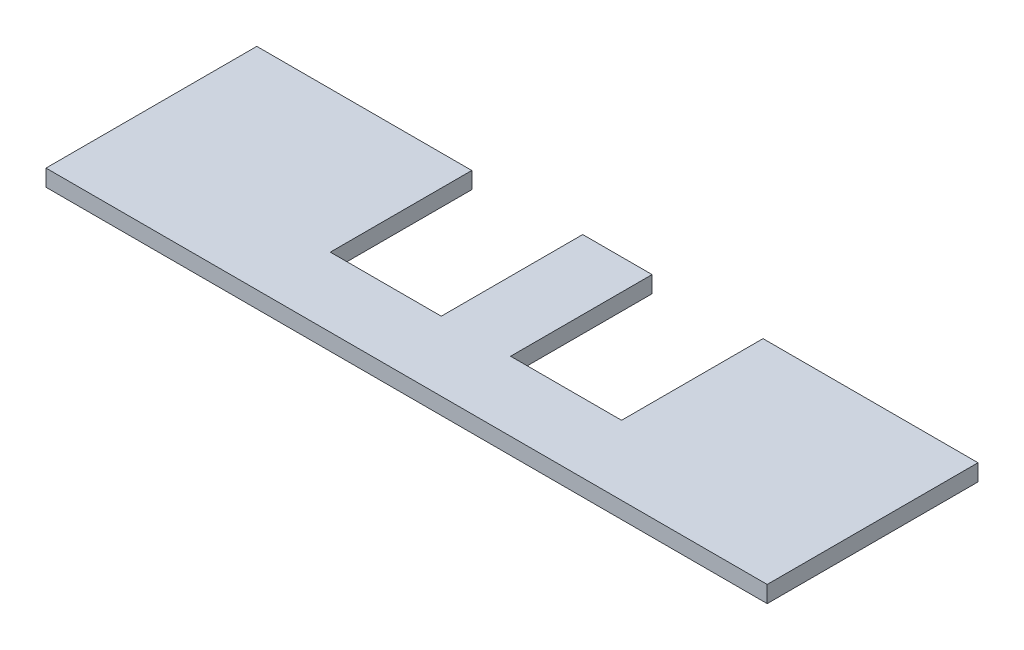
ISO-10303-21;
HEADER;
FILE_DESCRIPTION(('STEP AP214'),'2;1');
FILE_NAME('part.step','',(''),(''),'','','');
FILE_SCHEMA(('AUTOMOTIVE_DESIGN { 1 0 10303 214 1 1 1 1 }'));
ENDSEC;
DATA;
#1=APPLICATION_CONTEXT('core data for automotive mechanical design processes');
#2=APPLICATION_PROTOCOL_DEFINITION('international standard','automotive_design',2000,#1);
#3=PRODUCT_CONTEXT('',#1,'mechanical');
#4=PRODUCT('Part','Part','',(#3));
#5=PRODUCT_RELATED_PRODUCT_CATEGORY('part','',(#4));
#6=PRODUCT_DEFINITION_FORMATION('','',#4);
#7=PRODUCT_DEFINITION_CONTEXT('part definition',#1,'design');
#8=PRODUCT_DEFINITION('design','',#6,#7);
#9=PRODUCT_DEFINITION_SHAPE('','',#8);
#10=(LENGTH_UNIT() NAMED_UNIT(*) SI_UNIT(.MILLI.,.METRE.));
#11=(NAMED_UNIT(*) PLANE_ANGLE_UNIT() SI_UNIT($,.RADIAN.));
#12=(NAMED_UNIT(*) SI_UNIT($,.STERADIAN.) SOLID_ANGLE_UNIT());
#13=UNCERTAINTY_MEASURE_WITH_UNIT(LENGTH_MEASURE(1.E-05),#10,'distance_accuracy_value','');
#14=(GEOMETRIC_REPRESENTATION_CONTEXT(3) GLOBAL_UNCERTAINTY_ASSIGNED_CONTEXT((#13)) GLOBAL_UNIT_ASSIGNED_CONTEXT((#10,
#11,#12)) REPRESENTATION_CONTEXT('',''));
#15=CARTESIAN_POINT('',(0.,0.,0.));
#16=DIRECTION('',(0.,0.,1.));
#17=DIRECTION('',(1.,0.,0.));
#18=AXIS2_PLACEMENT_3D('',#15,#16,#17);
#19=CARTESIAN_POINT('',(0.,3.,0.));
#20=DIRECTION('',(0.,-1.,0.));
#21=DIRECTION('',(0.,0.,-1.));
#22=AXIS2_PLACEMENT_3D('',#19,#20,#21);
#23=PLANE('',#22);
#24=DIRECTION('',(0.,0.,-1.));
#25=VECTOR('',#24,1.);
#26=CARTESIAN_POINT('',(65.,3.,60.));
#27=LINE('',#26,#25);
#28=CARTESIAN_POINT('',(65.,3.,60.));
#29=VERTEX_POINT('',#28);
#30=CARTESIAN_POINT('',(65.,3.,22.));
#31=VERTEX_POINT('',#30);
#32=EDGE_CURVE('E146',#29,#31,#27,.T.);
#33=ORIENTED_EDGE('',*,*,#32,.T.);
#34=DIRECTION('',(-1.,0.,0.));
#35=VECTOR('',#34,1.);
#36=CARTESIAN_POINT('',(0.,3.,22.));
#37=LINE('',#36,#35);
#38=CARTESIAN_POINT('',(26.25,3.,22.));
#39=VERTEX_POINT('',#38);
#40=EDGE_CURVE('E213',#31,#39,#37,.T.);
#41=ORIENTED_EDGE('',*,*,#40,.T.);
#42=DIRECTION('',(0.,0.,-1.));
#43=VECTOR('',#42,1.);
#44=CARTESIAN_POINT('',(26.25,3.,0.));
#45=LINE('',#44,#43);
#46=CARTESIAN_POINT('',(26.25,3.,47.5));
#47=VERTEX_POINT('',#46);
#48=EDGE_CURVE('E189',#47,#39,#45,.T.);
#49=ORIENTED_EDGE('',*,*,#48,.F.);
#50=DIRECTION('',(1.,0.,0.));
#51=VECTOR('',#50,1.);
#52=CARTESIAN_POINT('',(0.,3.,47.5));
#53=LINE('',#52,#51);
#54=CARTESIAN_POINT('',(6.25,3.,47.5));
#55=VERTEX_POINT('',#54);
#56=EDGE_CURVE('E192',#55,#47,#53,.T.);
#57=ORIENTED_EDGE('',*,*,#56,.F.);
#58=DIRECTION('',(0.,0.,1.));
#59=VECTOR('',#58,1.);
#60=CARTESIAN_POINT('',(6.25,3.,0.));
#61=LINE('',#60,#59);
#62=CARTESIAN_POINT('',(6.25,3.,22.));
#63=VERTEX_POINT('',#62);
#64=EDGE_CURVE('E187',#63,#55,#61,.T.);
#65=ORIENTED_EDGE('',*,*,#64,.F.);
#66=CARTESIAN_POINT('',(-6.25,3.,22.));
#67=VERTEX_POINT('',#66);
#68=EDGE_CURVE('E56',#63,#67,#37,.T.);
#69=ORIENTED_EDGE('',*,*,#68,.T.);
#70=DIRECTION('',(0.,0.,1.));
#71=VECTOR('',#70,1.);
#72=CARTESIAN_POINT('',(-6.25,3.,0.));
#73=LINE('',#72,#71);
#74=CARTESIAN_POINT('',(-6.25,3.,47.5));
#75=VERTEX_POINT('',#74);
#76=EDGE_CURVE('E149',#67,#75,#73,.T.);
#77=ORIENTED_EDGE('',*,*,#76,.T.);
#78=DIRECTION('',(-1.,0.,0.));
#79=VECTOR('',#78,1.);
#80=CARTESIAN_POINT('',(0.,3.,47.5));
#81=LINE('',#80,#79);
#82=CARTESIAN_POINT('',(-26.25,3.,47.5));
#83=VERTEX_POINT('',#82);
#84=EDGE_CURVE('E167',#75,#83,#81,.T.);
#85=ORIENTED_EDGE('',*,*,#84,.T.);
#86=DIRECTION('',(0.,0.,-1.));
#87=VECTOR('',#86,1.);
#88=CARTESIAN_POINT('',(-26.25,3.,0.));
#89=LINE('',#88,#87);
#90=CARTESIAN_POINT('',(-26.25,3.,22.));
#91=VERTEX_POINT('',#90);
#92=EDGE_CURVE('E170',#83,#91,#89,.T.);
#93=ORIENTED_EDGE('',*,*,#92,.T.);
#94=CARTESIAN_POINT('',(-65.,3.,22.));
#95=VERTEX_POINT('',#94);
#96=EDGE_CURVE('E48',#91,#95,#37,.T.);
#97=ORIENTED_EDGE('',*,*,#96,.T.);
#98=DIRECTION('',(0.,0.,1.));
#99=VECTOR('',#98,1.);
#100=CARTESIAN_POINT('',(-65.,3.,60.));
#101=LINE('',#100,#99);
#102=CARTESIAN_POINT('',(-65.,3.,60.));
#103=VERTEX_POINT('',#102);
#104=EDGE_CURVE('E136',#95,#103,#101,.T.);
#105=ORIENTED_EDGE('',*,*,#104,.T.);
#106=DIRECTION('',(1.,0.,0.));
#107=VECTOR('',#106,1.);
#108=CARTESIAN_POINT('',(-65.,3.,60.));
#109=LINE('',#108,#107);
#110=EDGE_CURVE('E155',#103,#29,#109,.T.);
#111=ORIENTED_EDGE('',*,*,#110,.T.);
#112=EDGE_LOOP('',(#33,#41,#49,#57,#65,#69,#77,#85,#93,#97,#105,#111));
#113=FACE_BOUND('',#112,.T.);
#114=ADVANCED_FACE('F33',(#113),#23,.F.);
#115=CARTESIAN_POINT('',(0.,0.,0.));
#116=DIRECTION('',(0.,-1.,0.));
#117=DIRECTION('',(0.,0.,-1.));
#118=AXIS2_PLACEMENT_3D('',#115,#116,#117);
#119=PLANE('',#118);
#120=DIRECTION('',(1.,0.,0.));
#121=VECTOR('',#120,1.);
#122=CARTESIAN_POINT('',(-65.,0.,22.));
#123=LINE('',#122,#121);
#124=CARTESIAN_POINT('',(26.25,0.,22.));
#125=VERTEX_POINT('',#124);
#126=CARTESIAN_POINT('',(65.,0.,22.));
#127=VERTEX_POINT('',#126);
#128=EDGE_CURVE('E129',#125,#127,#123,.T.);
#129=ORIENTED_EDGE('',*,*,#128,.T.);
#130=DIRECTION('',(0.,0.,-1.));
#131=VECTOR('',#130,1.);
#132=CARTESIAN_POINT('',(65.,0.,60.));
#133=LINE('',#132,#131);
#134=CARTESIAN_POINT('',(65.,0.,60.));
#135=VERTEX_POINT('',#134);
#136=EDGE_CURVE('E144',#135,#127,#133,.T.);
#137=ORIENTED_EDGE('',*,*,#136,.F.);
#138=DIRECTION('',(1.,0.,0.));
#139=VECTOR('',#138,1.);
#140=CARTESIAN_POINT('',(-65.,0.,60.));
#141=LINE('',#140,#139);
#142=CARTESIAN_POINT('',(-65.,0.,60.));
#143=VERTEX_POINT('',#142);
#144=EDGE_CURVE('E143',#143,#135,#141,.T.);
#145=ORIENTED_EDGE('',*,*,#144,.F.);
#146=DIRECTION('',(0.,0.,1.));
#147=VECTOR('',#146,1.);
#148=CARTESIAN_POINT('',(-65.,0.,60.));
#149=LINE('',#148,#147);
#150=CARTESIAN_POINT('',(-65.,0.,22.));
#151=VERTEX_POINT('',#150);
#152=EDGE_CURVE('E134',#151,#143,#149,.T.);
#153=ORIENTED_EDGE('',*,*,#152,.F.);
#154=CARTESIAN_POINT('',(-26.25,0.,22.));
#155=VERTEX_POINT('',#154);
#156=EDGE_CURVE('E119',#151,#155,#123,.T.);
#157=ORIENTED_EDGE('',*,*,#156,.T.);
#158=DIRECTION('',(0.,0.,1.));
#159=VECTOR('',#158,1.);
#160=CARTESIAN_POINT('',(-26.25,0.,47.5));
#161=LINE('',#160,#159);
#162=CARTESIAN_POINT('',(-26.25,0.,47.5));
#163=VERTEX_POINT('',#162);
#164=EDGE_CURVE('E182',#155,#163,#161,.T.);
#165=ORIENTED_EDGE('',*,*,#164,.T.);
#166=DIRECTION('',(1.,0.,0.));
#167=VECTOR('',#166,1.);
#168=CARTESIAN_POINT('',(-26.25,0.,47.5));
#169=LINE('',#168,#167);
#170=CARTESIAN_POINT('',(-6.25,0.,47.5));
#171=VERTEX_POINT('',#170);
#172=EDGE_CURVE('E177',#163,#171,#169,.T.);
#173=ORIENTED_EDGE('',*,*,#172,.T.);
#174=DIRECTION('',(0.,0.,-1.));
#175=VECTOR('',#174,1.);
#176=CARTESIAN_POINT('',(-6.25,0.,47.5));
#177=LINE('',#176,#175);
#178=CARTESIAN_POINT('',(-6.25000000000001,0.,22.));
#179=VERTEX_POINT('',#178);
#180=EDGE_CURVE('E184',#171,#179,#177,.T.);
#181=ORIENTED_EDGE('',*,*,#180,.T.);
#182=CARTESIAN_POINT('',(6.25000000000001,0.,22.));
#183=VERTEX_POINT('',#182);
#184=EDGE_CURVE('E127',#179,#183,#123,.T.);
#185=ORIENTED_EDGE('',*,*,#184,.T.);
#186=DIRECTION('',(0.,0.,-1.));
#187=VECTOR('',#186,1.);
#188=CARTESIAN_POINT('',(6.25,0.,47.5));
#189=LINE('',#188,#187);
#190=CARTESIAN_POINT('',(6.25,0.,47.5));
#191=VERTEX_POINT('',#190);
#192=EDGE_CURVE('E204',#191,#183,#189,.T.);
#193=ORIENTED_EDGE('',*,*,#192,.F.);
#194=DIRECTION('',(-1.,0.,0.));
#195=VECTOR('',#194,1.);
#196=CARTESIAN_POINT('',(26.25,0.,47.5));
#197=LINE('',#196,#195);
#198=CARTESIAN_POINT('',(26.25,0.,47.5));
#199=VERTEX_POINT('',#198);
#200=EDGE_CURVE('E202',#199,#191,#197,.T.);
#201=ORIENTED_EDGE('',*,*,#200,.F.);
#202=DIRECTION('',(0.,0.,1.));
#203=VECTOR('',#202,1.);
#204=CARTESIAN_POINT('',(26.25,0.,47.5));
#205=LINE('',#204,#203);
#206=EDGE_CURVE('E198',#125,#199,#205,.T.);
#207=ORIENTED_EDGE('',*,*,#206,.F.);
#208=EDGE_LOOP('',(#129,#137,#145,#153,#157,#165,#173,#181,#185,#193,#201,#207));
#209=FACE_BOUND('',#208,.T.);
#210=ADVANCED_FACE('F141',(#209),#119,.T.);
#211=CARTESIAN_POINT('',(65.,3.,60.));
#212=DIRECTION('',(-1.,0.,0.));
#213=DIRECTION('',(0.,0.,1.));
#214=AXIS2_PLACEMENT_3D('',#211,#212,#213);
#215=PLANE('',#214);
#216=ORIENTED_EDGE('',*,*,#136,.T.);
#217=DIRECTION('',(0.,1.,0.));
#218=VECTOR('',#217,1.);
#219=CARTESIAN_POINT('',(65.,0.,22.));
#220=LINE('',#219,#218);
#221=EDGE_CURVE('E137',#127,#31,#220,.T.);
#222=ORIENTED_EDGE('',*,*,#221,.T.);
#223=ORIENTED_EDGE('',*,*,#32,.F.);
#224=DIRECTION('',(0.,-1.,0.));
#225=VECTOR('',#224,1.);
#226=CARTESIAN_POINT('',(65.,3.,60.));
#227=LINE('',#226,#225);
#228=EDGE_CURVE('E153',#29,#135,#227,.T.);
#229=ORIENTED_EDGE('',*,*,#228,.T.);
#230=EDGE_LOOP('',(#216,#222,#223,#229));
#231=FACE_BOUND('',#230,.T.);
#232=ADVANCED_FACE('F35',(#231),#215,.F.);
#233=CARTESIAN_POINT('',(-65.,3.,60.));
#234=DIRECTION('',(1.,0.,0.));
#235=DIRECTION('',(0.,0.,-1.));
#236=AXIS2_PLACEMENT_3D('',#233,#234,#235);
#237=PLANE('',#236);
#238=ORIENTED_EDGE('',*,*,#104,.F.);
#239=DIRECTION('',(0.,1.,0.));
#240=VECTOR('',#239,1.);
#241=CARTESIAN_POINT('',(-65.,0.,22.));
#242=LINE('',#241,#240);
#243=EDGE_CURVE('E122',#151,#95,#242,.T.);
#244=ORIENTED_EDGE('',*,*,#243,.F.);
#245=ORIENTED_EDGE('',*,*,#152,.T.);
#246=DIRECTION('',(0.,-1.,0.));
#247=VECTOR('',#246,1.);
#248=CARTESIAN_POINT('',(-65.,3.,60.));
#249=LINE('',#248,#247);
#250=EDGE_CURVE('E41',#103,#143,#249,.T.);
#251=ORIENTED_EDGE('',*,*,#250,.F.);
#252=EDGE_LOOP('',(#238,#244,#245,#251));
#253=FACE_BOUND('',#252,.T.);
#254=ADVANCED_FACE('F132',(#253),#237,.F.);
#255=CARTESIAN_POINT('',(-65.,3.,60.));
#256=DIRECTION('',(0.,0.,-1.));
#257=DIRECTION('',(-1.,0.,0.));
#258=AXIS2_PLACEMENT_3D('',#255,#256,#257);
#259=PLANE('',#258);
#260=ORIENTED_EDGE('',*,*,#144,.T.);
#261=ORIENTED_EDGE('',*,*,#228,.F.);
#262=ORIENTED_EDGE('',*,*,#110,.F.);
#263=ORIENTED_EDGE('',*,*,#250,.T.);
#264=EDGE_LOOP('',(#260,#261,#262,#263));
#265=FACE_BOUND('',#264,.T.);
#266=ADVANCED_FACE('F158',(#265),#259,.F.);
#267=CARTESIAN_POINT('',(-6.25,0.,47.5));
#268=DIRECTION('',(1.,0.,0.));
#269=DIRECTION('',(0.,0.,-1.));
#270=AXIS2_PLACEMENT_3D('',#267,#268,#269);
#271=PLANE('',#270);
#272=ORIENTED_EDGE('',*,*,#76,.F.);
#273=DIRECTION('',(0.,-1.,0.));
#274=VECTOR('',#273,1.);
#275=CARTESIAN_POINT('',(-6.25,0.,22.));
#276=LINE('',#275,#274);
#277=EDGE_CURVE('E208',#67,#179,#276,.T.);
#278=ORIENTED_EDGE('',*,*,#277,.T.);
#279=ORIENTED_EDGE('',*,*,#180,.F.);
#280=DIRECTION('',(0.,1.,0.));
#281=VECTOR('',#280,1.);
#282=CARTESIAN_POINT('',(-6.25,0.,47.5));
#283=LINE('',#282,#281);
#284=EDGE_CURVE('E173',#171,#75,#283,.T.);
#285=ORIENTED_EDGE('',*,*,#284,.T.);
#286=EDGE_LOOP('',(#272,#278,#279,#285));
#287=FACE_BOUND('',#286,.T.);
#288=ADVANCED_FACE('F238',(#287),#271,.F.);
#289=CARTESIAN_POINT('',(-26.25,0.,47.5));
#290=DIRECTION('',(0.,0.,1.));
#291=DIRECTION('',(1.,0.,0.));
#292=AXIS2_PLACEMENT_3D('',#289,#290,#291);
#293=PLANE('',#292);
#294=ORIENTED_EDGE('',*,*,#284,.F.);
#295=ORIENTED_EDGE('',*,*,#172,.F.);
#296=DIRECTION('',(0.,1.,0.));
#297=VECTOR('',#296,1.);
#298=CARTESIAN_POINT('',(-26.25,0.,47.5));
#299=LINE('',#298,#297);
#300=EDGE_CURVE('E174',#163,#83,#299,.T.);
#301=ORIENTED_EDGE('',*,*,#300,.T.);
#302=ORIENTED_EDGE('',*,*,#84,.F.);
#303=EDGE_LOOP('',(#294,#295,#301,#302));
#304=FACE_BOUND('',#303,.T.);
#305=ADVANCED_FACE('F242',(#304),#293,.F.);
#306=CARTESIAN_POINT('',(-26.25,0.,47.5));
#307=DIRECTION('',(-1.,0.,0.));
#308=DIRECTION('',(0.,0.,1.));
#309=AXIS2_PLACEMENT_3D('',#306,#307,#308);
#310=PLANE('',#309);
#311=ORIENTED_EDGE('',*,*,#164,.F.);
#312=DIRECTION('',(0.,1.,0.));
#313=VECTOR('',#312,1.);
#314=CARTESIAN_POINT('',(-26.25,0.,22.));
#315=LINE('',#314,#313);
#316=EDGE_CURVE('E123',#155,#91,#315,.T.);
#317=ORIENTED_EDGE('',*,*,#316,.T.);
#318=ORIENTED_EDGE('',*,*,#92,.F.);
#319=ORIENTED_EDGE('',*,*,#300,.F.);
#320=EDGE_LOOP('',(#311,#317,#318,#319));
#321=FACE_BOUND('',#320,.T.);
#322=ADVANCED_FACE('F245',(#321),#310,.F.);
#323=CARTESIAN_POINT('',(6.25,0.,47.5));
#324=DIRECTION('',(1.,0.,0.));
#325=DIRECTION('',(0.,0.,-1.));
#326=AXIS2_PLACEMENT_3D('',#323,#324,#325);
#327=PLANE('',#326);
#328=DIRECTION('',(0.,-1.,0.));
#329=VECTOR('',#328,1.);
#330=CARTESIAN_POINT('',(6.25,0.,22.));
#331=LINE('',#330,#329);
#332=EDGE_CURVE('E211',#63,#183,#331,.T.);
#333=ORIENTED_EDGE('',*,*,#332,.F.);
#334=ORIENTED_EDGE('',*,*,#64,.T.);
#335=DIRECTION('',(0.,1.,0.));
#336=VECTOR('',#335,1.);
#337=CARTESIAN_POINT('',(6.25,0.,47.5));
#338=LINE('',#337,#336);
#339=EDGE_CURVE('E195',#191,#55,#338,.T.);
#340=ORIENTED_EDGE('',*,*,#339,.F.);
#341=ORIENTED_EDGE('',*,*,#192,.T.);
#342=EDGE_LOOP('',(#333,#334,#340,#341));
#343=FACE_BOUND('',#342,.T.);
#344=ADVANCED_FACE('F233',(#343),#327,.T.);
#345=CARTESIAN_POINT('',(26.25,0.,47.5));
#346=DIRECTION('',(-1.,0.,0.));
#347=DIRECTION('',(0.,0.,1.));
#348=AXIS2_PLACEMENT_3D('',#345,#346,#347);
#349=PLANE('',#348);
#350=DIRECTION('',(0.,1.,0.));
#351=VECTOR('',#350,1.);
#352=CARTESIAN_POINT('',(26.25,0.,22.));
#353=LINE('',#352,#351);
#354=EDGE_CURVE('E11',#125,#39,#353,.T.);
#355=ORIENTED_EDGE('',*,*,#354,.F.);
#356=ORIENTED_EDGE('',*,*,#206,.T.);
#357=DIRECTION('',(0.,1.,0.));
#358=VECTOR('',#357,1.);
#359=CARTESIAN_POINT('',(26.25,0.,47.5));
#360=LINE('',#359,#358);
#361=EDGE_CURVE('E194',#199,#47,#360,.T.);
#362=ORIENTED_EDGE('',*,*,#361,.T.);
#363=ORIENTED_EDGE('',*,*,#48,.T.);
#364=EDGE_LOOP('',(#355,#356,#362,#363));
#365=FACE_BOUND('',#364,.T.);
#366=ADVANCED_FACE('F223',(#365),#349,.T.);
#367=CARTESIAN_POINT('',(26.25,0.,47.5));
#368=DIRECTION('',(0.,0.,-1.));
#369=DIRECTION('',(-1.,0.,0.));
#370=AXIS2_PLACEMENT_3D('',#367,#368,#369);
#371=PLANE('',#370);
#372=ORIENTED_EDGE('',*,*,#56,.T.);
#373=ORIENTED_EDGE('',*,*,#361,.F.);
#374=ORIENTED_EDGE('',*,*,#200,.T.);
#375=ORIENTED_EDGE('',*,*,#339,.T.);
#376=EDGE_LOOP('',(#372,#373,#374,#375));
#377=FACE_BOUND('',#376,.T.);
#378=ADVANCED_FACE('F228',(#377),#371,.T.);
#379=CARTESIAN_POINT('',(-65.,0.,22.));
#380=DIRECTION('',(0.,0.,1.));
#381=DIRECTION('',(1.,0.,0.));
#382=AXIS2_PLACEMENT_3D('',#379,#380,#381);
#383=PLANE('',#382);
#384=ORIENTED_EDGE('',*,*,#221,.F.);
#385=ORIENTED_EDGE('',*,*,#128,.F.);
#386=ORIENTED_EDGE('',*,*,#354,.T.);
#387=ORIENTED_EDGE('',*,*,#40,.F.);
#388=EDGE_LOOP('',(#384,#385,#386,#387));
#389=FACE_BOUND('',#388,.T.);
#390=ADVANCED_FACE('F288',(#389),#383,.F.);
#391=ORIENTED_EDGE('',*,*,#68,.F.);
#392=ORIENTED_EDGE('',*,*,#332,.T.);
#393=ORIENTED_EDGE('',*,*,#184,.F.);
#394=ORIENTED_EDGE('',*,*,#277,.F.);
#395=EDGE_LOOP('',(#391,#392,#393,#394));
#396=FACE_BOUND('',#395,.T.);
#397=ADVANCED_FACE('F334',(#396),#383,.F.);
#398=ORIENTED_EDGE('',*,*,#316,.F.);
#399=ORIENTED_EDGE('',*,*,#156,.F.);
#400=ORIENTED_EDGE('',*,*,#243,.T.);
#401=ORIENTED_EDGE('',*,*,#96,.F.);
#402=EDGE_LOOP('',(#398,#399,#400,#401));
#403=FACE_BOUND('',#402,.T.);
#404=ADVANCED_FACE('F121',(#403),#383,.F.);
#405=CLOSED_SHELL('',(#114,#210,#232,#254,#266,#288,#305,#322,#344,#366,#378,#390,#397,#404));
#406=MANIFOLD_SOLID_BREP('B2',#405);
#407=ADVANCED_BREP_SHAPE_REPRESENTATION('',(#18,#406),#14);
#408=SHAPE_DEFINITION_REPRESENTATION(#9,#407);
ENDSEC;
END-ISO-10303-21;
